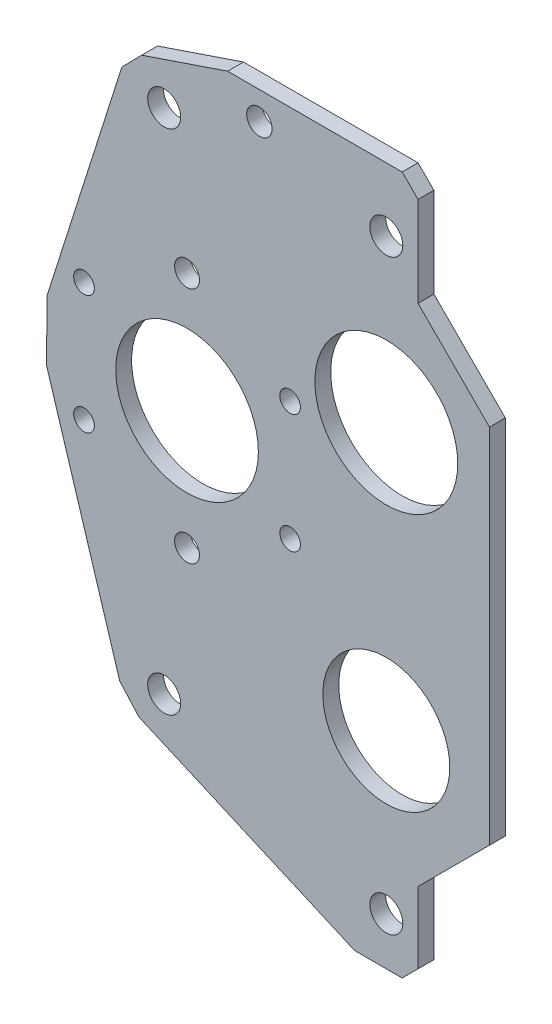
ISO-10303-21;
HEADER;
FILE_DESCRIPTION(('STEP AP214'),'2;1');
FILE_NAME('part.step','',(''),(''),'','','');
FILE_SCHEMA(('AUTOMOTIVE_DESIGN { 1 0 10303 214 1 1 1 1 }'));
ENDSEC;
DATA;
#1=APPLICATION_CONTEXT('core data for automotive mechanical design processes');
#2=APPLICATION_PROTOCOL_DEFINITION('international standard','automotive_design',2000,#1);
#3=PRODUCT_CONTEXT('',#1,'mechanical');
#4=PRODUCT('Part','Part','',(#3));
#5=PRODUCT_RELATED_PRODUCT_CATEGORY('part','',(#4));
#6=PRODUCT_DEFINITION_FORMATION('','',#4);
#7=PRODUCT_DEFINITION_CONTEXT('part definition',#1,'design');
#8=PRODUCT_DEFINITION('design','',#6,#7);
#9=PRODUCT_DEFINITION_SHAPE('','',#8);
#10=(LENGTH_UNIT() NAMED_UNIT(*) SI_UNIT(.MILLI.,.METRE.));
#11=(NAMED_UNIT(*) PLANE_ANGLE_UNIT() SI_UNIT($,.RADIAN.));
#12=(NAMED_UNIT(*) SI_UNIT($,.STERADIAN.) SOLID_ANGLE_UNIT());
#13=UNCERTAINTY_MEASURE_WITH_UNIT(LENGTH_MEASURE(1.E-05),#10,'distance_accuracy_value','');
#14=(GEOMETRIC_REPRESENTATION_CONTEXT(3) GLOBAL_UNCERTAINTY_ASSIGNED_CONTEXT((#13)) GLOBAL_UNIT_ASSIGNED_CONTEXT((#10,
#11,#12)) REPRESENTATION_CONTEXT('',''));
#15=CARTESIAN_POINT('',(0.,0.,0.));
#16=DIRECTION('',(0.,0.,1.));
#17=DIRECTION('',(1.,0.,0.));
#18=AXIS2_PLACEMENT_3D('',#15,#16,#17);
#19=CARTESIAN_POINT('',(0.,0.,0.));
#20=DIRECTION('',(0.,0.,1.));
#21=DIRECTION('',(1.,0.,0.));
#22=AXIS2_PLACEMENT_3D('',#19,#20,#21);
#23=PLANE('',#22);
#24=DIRECTION('',(-0.947188076798087,-0.32067857298476,0.));
#25=VECTOR('',#24,1.);
#26=CARTESIAN_POINT('',(-33.1609002039906,97.9473277455423,0.));
#27=LINE('',#26,#25);
#28=CARTESIAN_POINT('',(-48.9538078594664,92.6005046443076,0.));
#29=VERTEX_POINT('',#28);
#30=CARTESIAN_POINT('',(-31.75,98.425,0.));
#31=VERTEX_POINT('',#30);
#32=EDGE_CURVE('E666',#29,#31,#27,.F.);
#33=ORIENTED_EDGE('',*,*,#32,.F.);
#34=DIRECTION('',(0.7004757379388,0.713676215492077,0.));
#35=VECTOR('',#34,1.);
#36=CARTESIAN_POINT('',(-48.9538078594664,92.6005046443076,0.));
#37=LINE('',#36,#35);
#38=CARTESIAN_POINT('',(-52.9229679271194,88.5565456856429,0.));
#39=VERTEX_POINT('',#38);
#40=EDGE_CURVE('E658',#29,#39,#37,.F.);
#41=ORIENTED_EDGE('',*,*,#40,.T.);
#42=DIRECTION('',(-0.302941078368201,-0.953009288011985,0.));
#43=VECTOR('',#42,1.);
#44=CARTESIAN_POINT('',(-73.6328287693253,23.4062866241446,0.));
#45=LINE('',#44,#43);
#46=CARTESIAN_POINT('',(-67.9263241523619,41.3581336676134,0.));
#47=VERTEX_POINT('',#46);
#48=EDGE_CURVE('E656',#47,#39,#45,.F.);
#49=ORIENTED_EDGE('',*,*,#48,.F.);
#50=DIRECTION('',(0.00396394921512312,0.999992143522448,0.));
#51=VECTOR('',#50,1.);
#52=CARTESIAN_POINT('',(-67.9263241523619,41.3581336676133,0.));
#53=LINE('',#52,#51);
#54=CARTESIAN_POINT('',(-67.9743607697863,29.2398552995184,0.));
#55=VERTEX_POINT('',#54);
#56=EDGE_CURVE('E649',#47,#55,#53,.F.);
#57=ORIENTED_EDGE('',*,*,#56,.T.);
#58=DIRECTION('',(0.295376256726555,-0.955381006176179,0.));
#59=VECTOR('',#58,1.);
#60=CARTESIAN_POINT('',(-53.7923971636767,-16.6310579882147,0.));
#61=LINE('',#60,#59);
#62=CARTESIAN_POINT('',(-53.3456573135953,-18.0760176210564,0.));
#63=VERTEX_POINT('',#62);
#64=EDGE_CURVE('E145',#63,#55,#61,.F.);
#65=ORIENTED_EDGE('',*,*,#64,.F.);
#66=DIRECTION('',(-0.666107578502949,0.745855678976126,0.));
#67=VECTOR('',#66,1.);
#68=CARTESIAN_POINT('',(-53.3456573135953,-18.0760176210564,0.));
#69=LINE('',#68,#67);
#70=CARTESIAN_POINT('',(-49.4993940732019,-22.3827653195768,0.));
#71=VERTEX_POINT('',#70);
#72=EDGE_CURVE('E140',#63,#71,#69,.F.);
#73=ORIENTED_EDGE('',*,*,#72,.T.);
#74=DIRECTION('',(0.916045236310745,-0.401074961861734,0.));
#75=VECTOR('',#74,1.);
#76=CARTESIAN_POINT('',(-16.1860190531105,-36.9684648964657,0.));
#77=LINE('',#76,#75);
#78=CARTESIAN_POINT('',(-6.34999999999987,-41.275,0.));
#79=VERTEX_POINT('',#78);
#80=EDGE_CURVE('E131',#79,#71,#77,.F.);
#81=ORIENTED_EDGE('',*,*,#80,.F.);
#82=DIRECTION('',(1.,0.,0.));
#83=VECTOR('',#82,1.);
#84=CARTESIAN_POINT('',(-76.2,-41.275,0.));
#85=LINE('',#84,#83);
#86=CARTESIAN_POINT('',(3.17499999999999,-41.275,0.));
#87=VERTEX_POINT('',#86);
#88=EDGE_CURVE('E126',#87,#79,#85,.F.);
#89=ORIENTED_EDGE('',*,*,#88,.F.);
#90=DIRECTION('',(0.707106781186547,0.707106781186548,0.));
#91=VECTOR('',#90,1.);
#92=CARTESIAN_POINT('',(6.35,-38.1,0.));
#93=LINE('',#92,#91);
#94=CARTESIAN_POINT('',(6.35,-38.1,0.));
#95=VERTEX_POINT('',#94);
#96=EDGE_CURVE('E703',#95,#87,#93,.F.);
#97=ORIENTED_EDGE('',*,*,#96,.F.);
#98=DIRECTION('',(0.,-1.,0.));
#99=VECTOR('',#98,1.);
#100=CARTESIAN_POINT('',(6.35000000000001,-23.8252,0.));
#101=LINE('',#100,#99);
#102=CARTESIAN_POINT('',(6.35,-23.8252,0.));
#103=VERTEX_POINT('',#102);
#104=EDGE_CURVE('E697',#95,#103,#101,.F.);
#105=ORIENTED_EDGE('',*,*,#104,.T.);
#106=DIRECTION('',(-0.707106781186549,-0.707106781186546,0.));
#107=VECTOR('',#106,1.);
#108=CARTESIAN_POINT('',(20.6502,-9.525,0.));
#109=LINE('',#108,#107);
#110=CARTESIAN_POINT('',(20.6502,-9.52500000000001,0.));
#111=VERTEX_POINT('',#110);
#112=EDGE_CURVE('E692',#103,#111,#109,.F.);
#113=ORIENTED_EDGE('',*,*,#112,.T.);
#114=DIRECTION('',(0.,-1.,0.));
#115=VECTOR('',#114,1.);
#116=CARTESIAN_POINT('',(20.6502,62.9412,0.));
#117=LINE('',#116,#115);
#118=CARTESIAN_POINT('',(20.6502,62.9412,0.));
#119=VERTEX_POINT('',#118);
#120=EDGE_CURVE('E687',#111,#119,#117,.F.);
#121=ORIENTED_EDGE('',*,*,#120,.T.);
#122=DIRECTION('',(0.707106781186549,-0.707106781186546,0.));
#123=VECTOR('',#122,1.);
#124=CARTESIAN_POINT('',(6.35000000000002,77.2414,0.));
#125=LINE('',#124,#123);
#126=CARTESIAN_POINT('',(6.35000000000002,77.2414,0.));
#127=VERTEX_POINT('',#126);
#128=EDGE_CURVE('E682',#119,#127,#125,.F.);
#129=ORIENTED_EDGE('',*,*,#128,.T.);
#130=DIRECTION('',(0.,-1.,0.));
#131=VECTOR('',#130,1.);
#132=CARTESIAN_POINT('',(6.35000000000002,98.425,0.));
#133=LINE('',#132,#131);
#134=CARTESIAN_POINT('',(6.35000000000002,95.25,0.));
#135=VERTEX_POINT('',#134);
#136=EDGE_CURVE('E676',#127,#135,#133,.F.);
#137=ORIENTED_EDGE('',*,*,#136,.T.);
#138=DIRECTION('',(-0.707106781186547,0.707106781186548,0.));
#139=VECTOR('',#138,1.);
#140=CARTESIAN_POINT('',(3.17500000000003,98.425,0.));
#141=LINE('',#140,#139);
#142=CARTESIAN_POINT('',(3.17500000000003,98.425,0.));
#143=VERTEX_POINT('',#142);
#144=EDGE_CURVE('E674',#143,#135,#141,.F.);
#145=ORIENTED_EDGE('',*,*,#144,.F.);
#146=DIRECTION('',(1.,0.,0.));
#147=VECTOR('',#146,1.);
#148=CARTESIAN_POINT('',(-76.2,98.425,0.));
#149=LINE('',#148,#147);
#150=EDGE_CURVE('E670',#31,#143,#149,.T.);
#151=ORIENTED_EDGE('',*,*,#150,.F.);
#152=EDGE_LOOP('',(#33,#41,#49,#57,#65,#73,#81,#89,#97,#105,#113,#121,#129,#137,#145,#151));
#153=FACE_BOUND('',#152,.T.);
#154=CARTESIAN_POINT('',(0.,-31.75,0.));
#155=DIRECTION('',(0.,0.,1.));
#156=DIRECTION('',(1.,0.,0.));
#157=AXIS2_PLACEMENT_3D('',#154,#155,#156);
#158=CIRCLE('',#157,3.302);
#159=CARTESIAN_POINT('',(3.30199999999998,-31.75,0.));
#160=VERTEX_POINT('',#159);
#161=EDGE_CURVE('E149',#160,#160,#158,.F.);
#162=ORIENTED_EDGE('',*,*,#161,.T.);
#163=EDGE_LOOP('',(#162));
#164=FACE_BOUND('',#163,.T.);
#165=CARTESIAN_POINT('',(0.,85.725,0.));
#166=DIRECTION('',(0.,0.,1.));
#167=DIRECTION('',(1.,0.,0.));
#168=AXIS2_PLACEMENT_3D('',#165,#166,#167);
#169=CIRCLE('',#168,3.30199999999999);
#170=CARTESIAN_POINT('',(3.30199999999996,85.725,0.));
#171=VERTEX_POINT('',#170);
#172=EDGE_CURVE('E203',#171,#171,#169,.F.);
#173=ORIENTED_EDGE('',*,*,#172,.T.);
#174=EDGE_LOOP('',(#173));
#175=FACE_BOUND('',#174,.T.);
#176=CARTESIAN_POINT('',(-25.4,92.8624,0.));
#177=DIRECTION('',(0.,0.,1.));
#178=DIRECTION('',(1.,0.,0.));
#179=AXIS2_PLACEMENT_3D('',#176,#177,#178);
#180=CIRCLE('',#179,2.54);
#181=CARTESIAN_POINT('',(-22.86,92.8624,0.));
#182=VERTEX_POINT('',#181);
#183=EDGE_CURVE('E206',#182,#182,#180,.F.);
#184=ORIENTED_EDGE('',*,*,#183,.T.);
#185=EDGE_LOOP('',(#184));
#186=FACE_BOUND('',#185,.T.);
#187=CARTESIAN_POINT('',(0.,53.4162,0.));
#188=DIRECTION('',(0.,0.,1.));
#189=DIRECTION('',(1.,0.,0.));
#190=AXIS2_PLACEMENT_3D('',#187,#188,#189);
#191=CIRCLE('',#190,14.3002);
#192=CARTESIAN_POINT('',(14.3002,53.4162,0.));
#193=VERTEX_POINT('',#192);
#194=EDGE_CURVE('E209',#193,#193,#191,.F.);
#195=ORIENTED_EDGE('',*,*,#194,.T.);
#196=EDGE_LOOP('',(#195));
#197=FACE_BOUND('',#196,.T.);
#198=CARTESIAN_POINT('',(-39.878,35.5392112804997,0.));
#199=DIRECTION('',(0.,0.,1.));
#200=DIRECTION('',(1.,0.,0.));
#201=AXIS2_PLACEMENT_3D('',#198,#199,#200);
#202=CIRCLE('',#201,14.2748);
#203=CARTESIAN_POINT('',(-25.6032,35.5392112804997,0.));
#204=VERTEX_POINT('',#203);
#205=EDGE_CURVE('E212',#204,#204,#202,.F.);
#206=ORIENTED_EDGE('',*,*,#205,.T.);
#207=EDGE_LOOP('',(#206));
#208=FACE_BOUND('',#207,.T.);
#209=CARTESIAN_POINT('',(0.,0.,0.));
#210=DIRECTION('',(0.,0.,1.));
#211=DIRECTION('',(1.,0.,0.));
#212=AXIS2_PLACEMENT_3D('',#209,#210,#211);
#213=CIRCLE('',#212,12.7);
#214=CARTESIAN_POINT('',(12.7,0.,0.));
#215=VERTEX_POINT('',#214);
#216=EDGE_CURVE('E215',#215,#215,#213,.F.);
#217=ORIENTED_EDGE('',*,*,#216,.T.);
#218=EDGE_LOOP('',(#217));
#219=FACE_BOUND('',#218,.T.);
#220=CARTESIAN_POINT('',(-44.45,-15.875,0.));
#221=DIRECTION('',(0.,0.,1.));
#222=DIRECTION('',(1.,0.,0.));
#223=AXIS2_PLACEMENT_3D('',#220,#221,#222);
#224=CIRCLE('',#223,3.302);
#225=CARTESIAN_POINT('',(-41.148,-15.875,0.));
#226=VERTEX_POINT('',#225);
#227=EDGE_CURVE('E218',#226,#226,#224,.F.);
#228=ORIENTED_EDGE('',*,*,#227,.T.);
#229=EDGE_LOOP('',(#228));
#230=FACE_BOUND('',#229,.T.);
#231=CARTESIAN_POINT('',(-44.45,85.725,0.));
#232=DIRECTION('',(0.,0.,1.));
#233=DIRECTION('',(1.,0.,0.));
#234=AXIS2_PLACEMENT_3D('',#231,#232,#233);
#235=CIRCLE('',#234,3.302);
#236=CARTESIAN_POINT('',(-41.148,85.725,0.));
#237=VERTEX_POINT('',#236);
#238=EDGE_CURVE('E221',#237,#237,#235,.F.);
#239=ORIENTED_EDGE('',*,*,#238,.T.);
#240=EDGE_LOOP('',(#239));
#241=FACE_BOUND('',#240,.T.);
#242=CARTESIAN_POINT('',(-39.878,11.7267112804997,0.));
#243=DIRECTION('',(0.,0.,-1.));
#244=DIRECTION('',(-1.,0.,0.));
#245=AXIS2_PLACEMENT_3D('',#242,#243,#244);
#246=CIRCLE('',#245,2.4892);
#247=CARTESIAN_POINT('',(-42.3672,11.7267112804997,0.));
#248=VERTEX_POINT('',#247);
#249=EDGE_CURVE('E224',#248,#248,#246,.T.);
#250=ORIENTED_EDGE('',*,*,#249,.T.);
#251=EDGE_LOOP('',(#250));
#252=FACE_BOUND('',#251,.T.);
#253=CARTESIAN_POINT('',(-19.255770072383,23.6329612804998,0.));
#254=DIRECTION('',(0.,0.,-1.));
#255=DIRECTION('',(-1.,0.,0.));
#256=AXIS2_PLACEMENT_3D('',#253,#254,#255);
#257=CIRCLE('',#256,2.0701);
#258=CARTESIAN_POINT('',(-21.325870072383,23.6329612804998,0.));
#259=VERTEX_POINT('',#258);
#260=EDGE_CURVE('E227',#259,#259,#257,.T.);
#261=ORIENTED_EDGE('',*,*,#260,.T.);
#262=EDGE_LOOP('',(#261));
#263=FACE_BOUND('',#262,.T.);
#264=CARTESIAN_POINT('',(-19.2557700723831,47.4454612804998,0.));
#265=DIRECTION('',(0.,0.,-1.));
#266=DIRECTION('',(-1.,0.,0.));
#267=AXIS2_PLACEMENT_3D('',#264,#265,#266);
#268=CIRCLE('',#267,2.07010000000001);
#269=CARTESIAN_POINT('',(-21.3258700723831,47.4454612804998,0.));
#270=VERTEX_POINT('',#269);
#271=EDGE_CURVE('E230',#270,#270,#268,.T.);
#272=ORIENTED_EDGE('',*,*,#271,.T.);
#273=EDGE_LOOP('',(#272));
#274=FACE_BOUND('',#273,.T.);
#275=CARTESIAN_POINT('',(-39.878,59.3517112804997,0.));
#276=DIRECTION('',(0.,0.,-1.));
#277=DIRECTION('',(-1.,0.,0.));
#278=AXIS2_PLACEMENT_3D('',#275,#276,#277);
#279=CIRCLE('',#278,2.4892);
#280=CARTESIAN_POINT('',(-42.3672,59.3517112804997,0.));
#281=VERTEX_POINT('',#280);
#282=EDGE_CURVE('E233',#281,#281,#279,.T.);
#283=ORIENTED_EDGE('',*,*,#282,.T.);
#284=EDGE_LOOP('',(#283));
#285=FACE_BOUND('',#284,.T.);
#286=CARTESIAN_POINT('',(-60.5002299276169,23.6329612804996,0.));
#287=DIRECTION('',(0.,0.,-1.));
#288=DIRECTION('',(-1.,0.,0.));
#289=AXIS2_PLACEMENT_3D('',#286,#287,#288);
#290=CIRCLE('',#289,2.0701);
#291=CARTESIAN_POINT('',(-62.5703299276169,23.6329612804996,0.));
#292=VERTEX_POINT('',#291);
#293=EDGE_CURVE('E235',#292,#292,#290,.T.);
#294=ORIENTED_EDGE('',*,*,#293,.T.);
#295=EDGE_LOOP('',(#294));
#296=FACE_BOUND('',#295,.T.);
#297=CARTESIAN_POINT('',(-60.500229927617,47.4454612804997,0.));
#298=DIRECTION('',(0.,0.,-1.));
#299=DIRECTION('',(-1.,0.,0.));
#300=AXIS2_PLACEMENT_3D('',#297,#298,#299);
#301=CIRCLE('',#300,2.07009999999999);
#302=CARTESIAN_POINT('',(-62.570329927617,47.4454612804997,0.));
#303=VERTEX_POINT('',#302);
#304=EDGE_CURVE('E20',#303,#303,#301,.T.);
#305=ORIENTED_EDGE('',*,*,#304,.T.);
#306=EDGE_LOOP('',(#305));
#307=FACE_BOUND('',#306,.T.);
#308=ADVANCED_FACE('F17',(#153,#164,#175,#186,#197,#208,#219,#230,#241,#252,#263,#274,#285,#296,
#307),#23,.T.);
#309=CARTESIAN_POINT('',(-60.500229927617,47.4454612804997,0.));
#310=DIRECTION('',(0.,0.,-1.));
#311=DIRECTION('',(-1.,0.,0.));
#312=AXIS2_PLACEMENT_3D('',#309,#310,#311);
#313=CYLINDRICAL_SURFACE('',#312,2.07009999999999);
#314=ORIENTED_EDGE('',*,*,#304,.F.);
#315=EDGE_LOOP('',(#314));
#316=FACE_BOUND('',#315,.T.);
#317=CARTESIAN_POINT('',(-60.500229927617,47.4454612804997,-3.175));
#318=DIRECTION('',(0.,0.,-1.));
#319=DIRECTION('',(-1.,0.,0.));
#320=AXIS2_PLACEMENT_3D('',#317,#318,#319);
#321=CIRCLE('',#320,2.07009999999999);
#322=CARTESIAN_POINT('',(-62.570329927617,47.4454612804997,-3.175));
#323=VERTEX_POINT('',#322);
#324=EDGE_CURVE('E197',#323,#323,#321,.T.);
#325=ORIENTED_EDGE('',*,*,#324,.T.);
#326=EDGE_LOOP('',(#325));
#327=FACE_BOUND('',#326,.T.);
#328=ADVANCED_FACE('F243',(#316,#327),#313,.F.);
#329=CARTESIAN_POINT('',(-60.5002299276169,23.6329612804996,0.));
#330=DIRECTION('',(0.,0.,-1.));
#331=DIRECTION('',(-1.,0.,0.));
#332=AXIS2_PLACEMENT_3D('',#329,#330,#331);
#333=CYLINDRICAL_SURFACE('',#332,2.0701);
#334=ORIENTED_EDGE('',*,*,#293,.F.);
#335=EDGE_LOOP('',(#334));
#336=FACE_BOUND('',#335,.T.);
#337=CARTESIAN_POINT('',(-60.5002299276169,23.6329612804996,-3.175));
#338=DIRECTION('',(0.,0.,-1.));
#339=DIRECTION('',(-1.,0.,0.));
#340=AXIS2_PLACEMENT_3D('',#337,#338,#339);
#341=CIRCLE('',#340,2.0701);
#342=CARTESIAN_POINT('',(-62.5703299276169,23.6329612804996,-3.175));
#343=VERTEX_POINT('',#342);
#344=EDGE_CURVE('E194',#343,#343,#341,.T.);
#345=ORIENTED_EDGE('',*,*,#344,.T.);
#346=EDGE_LOOP('',(#345));
#347=FACE_BOUND('',#346,.T.);
#348=ADVANCED_FACE('F246',(#336,#347),#333,.F.);
#349=CARTESIAN_POINT('',(-39.878,59.3517112804997,0.));
#350=DIRECTION('',(0.,0.,-1.));
#351=DIRECTION('',(-1.,0.,0.));
#352=AXIS2_PLACEMENT_3D('',#349,#350,#351);
#353=CYLINDRICAL_SURFACE('',#352,2.4892);
#354=ORIENTED_EDGE('',*,*,#282,.F.);
#355=EDGE_LOOP('',(#354));
#356=FACE_BOUND('',#355,.T.);
#357=CARTESIAN_POINT('',(-39.878,59.3517112804997,-3.175));
#358=DIRECTION('',(0.,0.,-1.));
#359=DIRECTION('',(-1.,0.,0.));
#360=AXIS2_PLACEMENT_3D('',#357,#358,#359);
#361=CIRCLE('',#360,2.4892);
#362=CARTESIAN_POINT('',(-42.3672,59.3517112804997,-3.175));
#363=VERTEX_POINT('',#362);
#364=EDGE_CURVE('E191',#363,#363,#361,.T.);
#365=ORIENTED_EDGE('',*,*,#364,.T.);
#366=EDGE_LOOP('',(#365));
#367=FACE_BOUND('',#366,.T.);
#368=ADVANCED_FACE('F360',(#356,#367),#353,.F.);
#369=CARTESIAN_POINT('',(-19.2557700723831,47.4454612804998,0.));
#370=DIRECTION('',(0.,0.,-1.));
#371=DIRECTION('',(-1.,0.,0.));
#372=AXIS2_PLACEMENT_3D('',#369,#370,#371);
#373=CYLINDRICAL_SURFACE('',#372,2.07010000000001);
#374=ORIENTED_EDGE('',*,*,#271,.F.);
#375=EDGE_LOOP('',(#374));
#376=FACE_BOUND('',#375,.T.);
#377=CARTESIAN_POINT('',(-19.2557700723831,47.4454612804998,-3.175));
#378=DIRECTION('',(0.,0.,-1.));
#379=DIRECTION('',(-1.,0.,0.));
#380=AXIS2_PLACEMENT_3D('',#377,#378,#379);
#381=CIRCLE('',#380,2.07010000000001);
#382=CARTESIAN_POINT('',(-21.3258700723831,47.4454612804998,-3.175));
#383=VERTEX_POINT('',#382);
#384=EDGE_CURVE('E188',#383,#383,#381,.T.);
#385=ORIENTED_EDGE('',*,*,#384,.T.);
#386=EDGE_LOOP('',(#385));
#387=FACE_BOUND('',#386,.T.);
#388=ADVANCED_FACE('F356',(#376,#387),#373,.F.);
#389=CARTESIAN_POINT('',(-19.255770072383,23.6329612804998,0.));
#390=DIRECTION('',(0.,0.,-1.));
#391=DIRECTION('',(-1.,0.,0.));
#392=AXIS2_PLACEMENT_3D('',#389,#390,#391);
#393=CYLINDRICAL_SURFACE('',#392,2.0701);
#394=ORIENTED_EDGE('',*,*,#260,.F.);
#395=EDGE_LOOP('',(#394));
#396=FACE_BOUND('',#395,.T.);
#397=CARTESIAN_POINT('',(-19.255770072383,23.6329612804998,-3.175));
#398=DIRECTION('',(0.,0.,-1.));
#399=DIRECTION('',(-1.,0.,0.));
#400=AXIS2_PLACEMENT_3D('',#397,#398,#399);
#401=CIRCLE('',#400,2.0701);
#402=CARTESIAN_POINT('',(-21.325870072383,23.6329612804998,-3.175));
#403=VERTEX_POINT('',#402);
#404=EDGE_CURVE('E185',#403,#403,#401,.T.);
#405=ORIENTED_EDGE('',*,*,#404,.T.);
#406=EDGE_LOOP('',(#405));
#407=FACE_BOUND('',#406,.T.);
#408=ADVANCED_FACE('F352',(#396,#407),#393,.F.);
#409=CARTESIAN_POINT('',(-39.878,11.7267112804997,0.));
#410=DIRECTION('',(0.,0.,-1.));
#411=DIRECTION('',(-1.,0.,0.));
#412=AXIS2_PLACEMENT_3D('',#409,#410,#411);
#413=CYLINDRICAL_SURFACE('',#412,2.4892);
#414=ORIENTED_EDGE('',*,*,#249,.F.);
#415=EDGE_LOOP('',(#414));
#416=FACE_BOUND('',#415,.T.);
#417=CARTESIAN_POINT('',(-39.878,11.7267112804997,-3.175));
#418=DIRECTION('',(0.,0.,-1.));
#419=DIRECTION('',(-1.,0.,0.));
#420=AXIS2_PLACEMENT_3D('',#417,#418,#419);
#421=CIRCLE('',#420,2.4892);
#422=CARTESIAN_POINT('',(-42.3672,11.7267112804997,-3.175));
#423=VERTEX_POINT('',#422);
#424=EDGE_CURVE('E182',#423,#423,#421,.T.);
#425=ORIENTED_EDGE('',*,*,#424,.T.);
#426=EDGE_LOOP('',(#425));
#427=FACE_BOUND('',#426,.T.);
#428=ADVANCED_FACE('F348',(#416,#427),#413,.F.);
#429=CARTESIAN_POINT('',(-44.45,85.725,-3.175));
#430=DIRECTION('',(0.,0.,1.));
#431=DIRECTION('',(1.,0.,0.));
#432=AXIS2_PLACEMENT_3D('',#429,#430,#431);
#433=CYLINDRICAL_SURFACE('',#432,3.302);
#434=CARTESIAN_POINT('',(-44.45,85.725,-3.175));
#435=DIRECTION('',(0.,0.,1.));
#436=DIRECTION('',(1.,0.,0.));
#437=AXIS2_PLACEMENT_3D('',#434,#435,#436);
#438=CIRCLE('',#437,3.302);
#439=CARTESIAN_POINT('',(-41.148,85.725,-3.175));
#440=VERTEX_POINT('',#439);
#441=EDGE_CURVE('E179',#440,#440,#438,.F.);
#442=ORIENTED_EDGE('',*,*,#441,.T.);
#443=EDGE_LOOP('',(#442));
#444=FACE_BOUND('',#443,.T.);
#445=ORIENTED_EDGE('',*,*,#238,.F.);
#446=EDGE_LOOP('',(#445));
#447=FACE_BOUND('',#446,.T.);
#448=ADVANCED_FACE('F344',(#444,#447),#433,.F.);
#449=CARTESIAN_POINT('',(-44.45,-15.875,-3.175));
#450=DIRECTION('',(0.,0.,1.));
#451=DIRECTION('',(1.,0.,0.));
#452=AXIS2_PLACEMENT_3D('',#449,#450,#451);
#453=CYLINDRICAL_SURFACE('',#452,3.302);
#454=CARTESIAN_POINT('',(-44.45,-15.875,-3.175));
#455=DIRECTION('',(0.,0.,1.));
#456=DIRECTION('',(1.,0.,0.));
#457=AXIS2_PLACEMENT_3D('',#454,#455,#456);
#458=CIRCLE('',#457,3.302);
#459=CARTESIAN_POINT('',(-41.148,-15.875,-3.175));
#460=VERTEX_POINT('',#459);
#461=EDGE_CURVE('E176',#460,#460,#458,.F.);
#462=ORIENTED_EDGE('',*,*,#461,.T.);
#463=EDGE_LOOP('',(#462));
#464=FACE_BOUND('',#463,.T.);
#465=ORIENTED_EDGE('',*,*,#227,.F.);
#466=EDGE_LOOP('',(#465));
#467=FACE_BOUND('',#466,.T.);
#468=ADVANCED_FACE('F340',(#464,#467),#453,.F.);
#469=CARTESIAN_POINT('',(0.,0.,-3.175));
#470=DIRECTION('',(0.,0.,1.));
#471=DIRECTION('',(1.,0.,0.));
#472=AXIS2_PLACEMENT_3D('',#469,#470,#471);
#473=CYLINDRICAL_SURFACE('',#472,12.7);
#474=CARTESIAN_POINT('',(0.,0.,-3.175));
#475=DIRECTION('',(0.,0.,1.));
#476=DIRECTION('',(1.,0.,0.));
#477=AXIS2_PLACEMENT_3D('',#474,#475,#476);
#478=CIRCLE('',#477,12.7);
#479=CARTESIAN_POINT('',(12.7,0.,-3.175));
#480=VERTEX_POINT('',#479);
#481=EDGE_CURVE('E173',#480,#480,#478,.F.);
#482=ORIENTED_EDGE('',*,*,#481,.T.);
#483=EDGE_LOOP('',(#482));
#484=FACE_BOUND('',#483,.T.);
#485=ORIENTED_EDGE('',*,*,#216,.F.);
#486=EDGE_LOOP('',(#485));
#487=FACE_BOUND('',#486,.T.);
#488=ADVANCED_FACE('F336',(#484,#487),#473,.F.);
#489=CARTESIAN_POINT('',(-39.878,35.5392112804997,-3.175));
#490=DIRECTION('',(0.,0.,1.));
#491=DIRECTION('',(1.,0.,0.));
#492=AXIS2_PLACEMENT_3D('',#489,#490,#491);
#493=CYLINDRICAL_SURFACE('',#492,14.2748);
#494=CARTESIAN_POINT('',(-39.878,35.5392112804997,-3.175));
#495=DIRECTION('',(0.,0.,1.));
#496=DIRECTION('',(1.,0.,0.));
#497=AXIS2_PLACEMENT_3D('',#494,#495,#496);
#498=CIRCLE('',#497,14.2748);
#499=CARTESIAN_POINT('',(-25.6032,35.5392112804997,-3.175));
#500=VERTEX_POINT('',#499);
#501=EDGE_CURVE('E170',#500,#500,#498,.F.);
#502=ORIENTED_EDGE('',*,*,#501,.T.);
#503=EDGE_LOOP('',(#502));
#504=FACE_BOUND('',#503,.T.);
#505=ORIENTED_EDGE('',*,*,#205,.F.);
#506=EDGE_LOOP('',(#505));
#507=FACE_BOUND('',#506,.T.);
#508=ADVANCED_FACE('F332',(#504,#507),#493,.F.);
#509=CARTESIAN_POINT('',(0.,53.4162,-3.175));
#510=DIRECTION('',(0.,0.,1.));
#511=DIRECTION('',(1.,0.,0.));
#512=AXIS2_PLACEMENT_3D('',#509,#510,#511);
#513=CYLINDRICAL_SURFACE('',#512,14.3002);
#514=CARTESIAN_POINT('',(0.,53.4162,-3.175));
#515=DIRECTION('',(0.,0.,1.));
#516=DIRECTION('',(1.,0.,0.));
#517=AXIS2_PLACEMENT_3D('',#514,#515,#516);
#518=CIRCLE('',#517,14.3002);
#519=CARTESIAN_POINT('',(14.3002,53.4162,-3.175));
#520=VERTEX_POINT('',#519);
#521=EDGE_CURVE('E167',#520,#520,#518,.F.);
#522=ORIENTED_EDGE('',*,*,#521,.T.);
#523=EDGE_LOOP('',(#522));
#524=FACE_BOUND('',#523,.T.);
#525=ORIENTED_EDGE('',*,*,#194,.F.);
#526=EDGE_LOOP('',(#525));
#527=FACE_BOUND('',#526,.T.);
#528=ADVANCED_FACE('F328',(#524,#527),#513,.F.);
#529=CARTESIAN_POINT('',(-25.4,92.8624,-3.175));
#530=DIRECTION('',(0.,0.,1.));
#531=DIRECTION('',(1.,0.,0.));
#532=AXIS2_PLACEMENT_3D('',#529,#530,#531);
#533=CYLINDRICAL_SURFACE('',#532,2.54);
#534=CARTESIAN_POINT('',(-25.4,92.8624,-3.175));
#535=DIRECTION('',(0.,0.,1.));
#536=DIRECTION('',(1.,0.,0.));
#537=AXIS2_PLACEMENT_3D('',#534,#535,#536);
#538=CIRCLE('',#537,2.54);
#539=CARTESIAN_POINT('',(-22.86,92.8624,-3.175));
#540=VERTEX_POINT('',#539);
#541=EDGE_CURVE('E164',#540,#540,#538,.F.);
#542=ORIENTED_EDGE('',*,*,#541,.T.);
#543=EDGE_LOOP('',(#542));
#544=FACE_BOUND('',#543,.T.);
#545=ORIENTED_EDGE('',*,*,#183,.F.);
#546=EDGE_LOOP('',(#545));
#547=FACE_BOUND('',#546,.T.);
#548=ADVANCED_FACE('F324',(#544,#547),#533,.F.);
#549=CARTESIAN_POINT('',(0.,85.725,-3.175));
#550=DIRECTION('',(0.,0.,1.));
#551=DIRECTION('',(1.,0.,0.));
#552=AXIS2_PLACEMENT_3D('',#549,#550,#551);
#553=CYLINDRICAL_SURFACE('',#552,3.30199999999999);
#554=CARTESIAN_POINT('',(0.,85.725,-3.175));
#555=DIRECTION('',(0.,0.,1.));
#556=DIRECTION('',(1.,0.,0.));
#557=AXIS2_PLACEMENT_3D('',#554,#555,#556);
#558=CIRCLE('',#557,3.30199999999999);
#559=CARTESIAN_POINT('',(3.30199999999996,85.725,-3.175));
#560=VERTEX_POINT('',#559);
#561=EDGE_CURVE('E161',#560,#560,#558,.F.);
#562=ORIENTED_EDGE('',*,*,#561,.T.);
#563=EDGE_LOOP('',(#562));
#564=FACE_BOUND('',#563,.T.);
#565=ORIENTED_EDGE('',*,*,#172,.F.);
#566=EDGE_LOOP('',(#565));
#567=FACE_BOUND('',#566,.T.);
#568=ADVANCED_FACE('F320',(#564,#567),#553,.F.);
#569=CARTESIAN_POINT('',(0.,-31.75,-3.175));
#570=DIRECTION('',(0.,0.,1.));
#571=DIRECTION('',(1.,0.,0.));
#572=AXIS2_PLACEMENT_3D('',#569,#570,#571);
#573=CYLINDRICAL_SURFACE('',#572,3.302);
#574=CARTESIAN_POINT('',(0.,-31.75,-3.175));
#575=DIRECTION('',(0.,0.,1.));
#576=DIRECTION('',(1.,0.,0.));
#577=AXIS2_PLACEMENT_3D('',#574,#575,#576);
#578=CIRCLE('',#577,3.302);
#579=CARTESIAN_POINT('',(3.30199999999998,-31.75,-3.175));
#580=VERTEX_POINT('',#579);
#581=EDGE_CURVE('E158',#580,#580,#578,.F.);
#582=ORIENTED_EDGE('',*,*,#581,.T.);
#583=EDGE_LOOP('',(#582));
#584=FACE_BOUND('',#583,.T.);
#585=ORIENTED_EDGE('',*,*,#161,.F.);
#586=EDGE_LOOP('',(#585));
#587=FACE_BOUND('',#586,.T.);
#588=ADVANCED_FACE('F317',(#584,#587),#573,.F.);
#589=CARTESIAN_POINT('',(-53.3456573135953,-18.0760176210564,-3.175));
#590=DIRECTION('',(0.745855678976126,0.666107578502949,0.));
#591=DIRECTION('',(-0.666107578502949,0.745855678976126,0.));
#592=AXIS2_PLACEMENT_3D('',#589,#590,#591);
#593=PLANE('',#592);
#594=DIRECTION('',(0.,0.,1.));
#595=VECTOR('',#594,1.);
#596=CARTESIAN_POINT('',(-49.4993940732019,-22.3827653195767,-3.175));
#597=LINE('',#596,#595);
#598=CARTESIAN_POINT('',(-49.4993940732019,-22.3827653195768,-3.175));
#599=VERTEX_POINT('',#598);
#600=EDGE_CURVE('E136',#71,#599,#597,.F.);
#601=ORIENTED_EDGE('',*,*,#600,.F.);
#602=ORIENTED_EDGE('',*,*,#72,.F.);
#603=DIRECTION('',(0.,0.,1.));
#604=VECTOR('',#603,1.);
#605=CARTESIAN_POINT('',(-53.3456573135953,-18.0760176210564,-3.175));
#606=LINE('',#605,#604);
#607=CARTESIAN_POINT('',(-53.3456573135953,-18.0760176210564,-3.175));
#608=VERTEX_POINT('',#607);
#609=EDGE_CURVE('E200',#608,#63,#606,.T.);
#610=ORIENTED_EDGE('',*,*,#609,.F.);
#611=DIRECTION('',(0.666107578502949,-0.745855678976125,0.));
#612=VECTOR('',#611,1.);
#613=CARTESIAN_POINT('',(-53.3456573135953,-18.0760176210564,-3.175));
#614=LINE('',#613,#612);
#615=EDGE_CURVE('E153',#608,#599,#614,.T.);
#616=ORIENTED_EDGE('',*,*,#615,.T.);
#617=EDGE_LOOP('',(#601,#602,#610,#616));
#618=FACE_BOUND('',#617,.T.);
#619=ADVANCED_FACE('F152',(#618),#593,.F.);
#620=CARTESIAN_POINT('',(-16.1860190531105,-36.9684648964657,-3.175));
#621=DIRECTION('',(-0.401074961861734,-0.916045236310745,0.));
#622=DIRECTION('',(0.916045236310745,-0.401074961861734,0.));
#623=AXIS2_PLACEMENT_3D('',#620,#621,#622);
#624=PLANE('',#623);
#625=DIRECTION('',(0.916045236310745,-0.401074961861733,0.));
#626=VECTOR('',#625,1.);
#627=CARTESIAN_POINT('',(-49.4993940732018,-22.3827653195768,-3.175));
#628=LINE('',#627,#626);
#629=CARTESIAN_POINT('',(-6.34999999999987,-41.275,-3.175));
#630=VERTEX_POINT('',#629);
#631=EDGE_CURVE('E637',#599,#630,#628,.T.);
#632=ORIENTED_EDGE('',*,*,#631,.T.);
#633=DIRECTION('',(0.,0.,-1.));
#634=VECTOR('',#633,1.);
#635=CARTESIAN_POINT('',(-6.34999999999987,-41.275,-3.175));
#636=LINE('',#635,#634);
#637=EDGE_CURVE('E138',#79,#630,#636,.T.);
#638=ORIENTED_EDGE('',*,*,#637,.F.);
#639=ORIENTED_EDGE('',*,*,#80,.T.);
#640=ORIENTED_EDGE('',*,*,#600,.T.);
#641=EDGE_LOOP('',(#632,#638,#639,#640));
#642=FACE_BOUND('',#641,.T.);
#643=ADVANCED_FACE('F134',(#642),#624,.T.);
#644=CARTESIAN_POINT('',(-76.2,-41.275,-3.175));
#645=DIRECTION('',(0.,-1.,0.));
#646=DIRECTION('',(0.,0.,-1.));
#647=AXIS2_PLACEMENT_3D('',#644,#645,#646);
#648=PLANE('',#647);
#649=DIRECTION('',(1.,0.,0.));
#650=VECTOR('',#649,1.);
#651=CARTESIAN_POINT('',(0.,-41.275,-3.175));
#652=LINE('',#651,#650);
#653=CARTESIAN_POINT('',(3.17499999999999,-41.275,-3.175));
#654=VERTEX_POINT('',#653);
#655=EDGE_CURVE('E633',#630,#654,#652,.T.);
#656=ORIENTED_EDGE('',*,*,#655,.T.);
#657=DIRECTION('',(0.,0.,1.));
#658=VECTOR('',#657,1.);
#659=CARTESIAN_POINT('',(3.175,-41.275,0.));
#660=LINE('',#659,#658);
#661=EDGE_CURVE('E634',#87,#654,#660,.F.);
#662=ORIENTED_EDGE('',*,*,#661,.F.);
#663=ORIENTED_EDGE('',*,*,#88,.T.);
#664=ORIENTED_EDGE('',*,*,#637,.T.);
#665=EDGE_LOOP('',(#656,#662,#663,#664));
#666=FACE_BOUND('',#665,.T.);
#667=ADVANCED_FACE('F309',(#666),#648,.T.);
#668=CARTESIAN_POINT('',(6.35,-38.1,0.));
#669=DIRECTION('',(0.707106781186548,-0.707106781186547,0.));
#670=DIRECTION('',(0.707106781186547,0.707106781186548,0.));
#671=AXIS2_PLACEMENT_3D('',#668,#669,#670);
#672=PLANE('',#671);
#673=DIRECTION('',(0.70710678118655,0.707106781186545,0.));
#674=VECTOR('',#673,1.);
#675=CARTESIAN_POINT('',(3.17499999999998,-41.275,-3.175));
#676=LINE('',#675,#674);
#677=CARTESIAN_POINT('',(6.35,-38.1,-3.175));
#678=VERTEX_POINT('',#677);
#679=EDGE_CURVE('E636',#654,#678,#676,.T.);
#680=ORIENTED_EDGE('',*,*,#679,.T.);
#681=DIRECTION('',(0.,0.,1.));
#682=VECTOR('',#681,1.);
#683=CARTESIAN_POINT('',(6.35,-38.1,0.));
#684=LINE('',#683,#682);
#685=EDGE_CURVE('E699',#678,#95,#684,.T.);
#686=ORIENTED_EDGE('',*,*,#685,.T.);
#687=ORIENTED_EDGE('',*,*,#96,.T.);
#688=ORIENTED_EDGE('',*,*,#661,.T.);
#689=EDGE_LOOP('',(#680,#686,#687,#688));
#690=FACE_BOUND('',#689,.T.);
#691=ADVANCED_FACE('F305',(#690),#672,.T.);
#692=CARTESIAN_POINT('',(6.35000000000001,-23.8252,0.));
#693=DIRECTION('',(-1.,0.,0.));
#694=DIRECTION('',(0.,-1.,0.));
#695=AXIS2_PLACEMENT_3D('',#692,#693,#694);
#696=PLANE('',#695);
#697=ORIENTED_EDGE('',*,*,#685,.F.);
#698=DIRECTION('',(0.,1.,0.));
#699=VECTOR('',#698,1.);
#700=CARTESIAN_POINT('',(6.35,0.,-3.175));
#701=LINE('',#700,#699);
#702=CARTESIAN_POINT('',(6.35,-23.8252,-3.175));
#703=VERTEX_POINT('',#702);
#704=EDGE_CURVE('E640',#678,#703,#701,.T.);
#705=ORIENTED_EDGE('',*,*,#704,.T.);
#706=DIRECTION('',(0.,0.,1.));
#707=VECTOR('',#706,1.);
#708=CARTESIAN_POINT('',(6.35,-23.8252,0.));
#709=LINE('',#708,#707);
#710=EDGE_CURVE('E694',#703,#103,#709,.T.);
#711=ORIENTED_EDGE('',*,*,#710,.T.);
#712=ORIENTED_EDGE('',*,*,#104,.F.);
#713=EDGE_LOOP('',(#697,#705,#711,#712));
#714=FACE_BOUND('',#713,.T.);
#715=ADVANCED_FACE('F301',(#714),#696,.F.);
#716=CARTESIAN_POINT('',(20.6502,-9.525,0.));
#717=DIRECTION('',(-0.707106781186546,0.707106781186549,0.));
#718=DIRECTION('',(-0.707106781186549,-0.707106781186546,0.));
#719=AXIS2_PLACEMENT_3D('',#716,#717,#718);
#720=PLANE('',#719);
#721=DIRECTION('',(0.,0.,1.));
#722=VECTOR('',#721,1.);
#723=CARTESIAN_POINT('',(20.6502,-9.52500000000001,0.));
#724=LINE('',#723,#722);
#725=CARTESIAN_POINT('',(20.6502,-9.52500000000001,-3.175));
#726=VERTEX_POINT('',#725);
#727=EDGE_CURVE('E689',#726,#111,#724,.T.);
#728=ORIENTED_EDGE('',*,*,#727,.T.);
#729=ORIENTED_EDGE('',*,*,#112,.F.);
#730=ORIENTED_EDGE('',*,*,#710,.F.);
#731=DIRECTION('',(0.707106781186549,0.707106781186546,0.));
#732=VECTOR('',#731,1.);
#733=CARTESIAN_POINT('',(6.35000000000001,-23.8252,-3.175));
#734=LINE('',#733,#732);
#735=EDGE_CURVE('E710',#703,#726,#734,.T.);
#736=ORIENTED_EDGE('',*,*,#735,.T.);
#737=EDGE_LOOP('',(#728,#729,#730,#736));
#738=FACE_BOUND('',#737,.T.);
#739=ADVANCED_FACE('F297',(#738),#720,.F.);
#740=CARTESIAN_POINT('',(20.6502,62.9412,0.));
#741=DIRECTION('',(-1.,0.,0.));
#742=DIRECTION('',(0.,-1.,0.));
#743=AXIS2_PLACEMENT_3D('',#740,#741,#742);
#744=PLANE('',#743);
#745=DIRECTION('',(0.,0.,1.));
#746=VECTOR('',#745,1.);
#747=CARTESIAN_POINT('',(20.6502,62.9412,0.));
#748=LINE('',#747,#746);
#749=CARTESIAN_POINT('',(20.6502,62.9412,-3.175));
#750=VERTEX_POINT('',#749);
#751=EDGE_CURVE('E684',#750,#119,#748,.T.);
#752=ORIENTED_EDGE('',*,*,#751,.T.);
#753=ORIENTED_EDGE('',*,*,#120,.F.);
#754=ORIENTED_EDGE('',*,*,#727,.F.);
#755=DIRECTION('',(0.,1.,0.));
#756=VECTOR('',#755,1.);
#757=CARTESIAN_POINT('',(20.6502,0.,-3.175));
#758=LINE('',#757,#756);
#759=EDGE_CURVE('E714',#726,#750,#758,.T.);
#760=ORIENTED_EDGE('',*,*,#759,.T.);
#761=EDGE_LOOP('',(#752,#753,#754,#760));
#762=FACE_BOUND('',#761,.T.);
#763=ADVANCED_FACE('F293',(#762),#744,.F.);
#764=CARTESIAN_POINT('',(6.35000000000002,77.2414,0.));
#765=DIRECTION('',(-0.707106781186546,-0.707106781186549,0.));
#766=DIRECTION('',(0.707106781186549,-0.707106781186546,0.));
#767=AXIS2_PLACEMENT_3D('',#764,#765,#766);
#768=PLANE('',#767);
#769=DIRECTION('',(0.,0.,1.));
#770=VECTOR('',#769,1.);
#771=CARTESIAN_POINT('',(6.35000000000001,77.2414,0.));
#772=LINE('',#771,#770);
#773=CARTESIAN_POINT('',(6.35000000000002,77.2414,-3.175));
#774=VERTEX_POINT('',#773);
#775=EDGE_CURVE('E679',#774,#127,#772,.T.);
#776=ORIENTED_EDGE('',*,*,#775,.T.);
#777=ORIENTED_EDGE('',*,*,#128,.F.);
#778=ORIENTED_EDGE('',*,*,#751,.F.);
#779=DIRECTION('',(-0.707106781186549,0.707106781186546,0.));
#780=VECTOR('',#779,1.);
#781=CARTESIAN_POINT('',(20.6502,62.9412,-3.175));
#782=LINE('',#781,#780);
#783=EDGE_CURVE('E716',#750,#774,#782,.T.);
#784=ORIENTED_EDGE('',*,*,#783,.T.);
#785=EDGE_LOOP('',(#776,#777,#778,#784));
#786=FACE_BOUND('',#785,.T.);
#787=ADVANCED_FACE('F289',(#786),#768,.F.);
#788=CARTESIAN_POINT('',(6.35000000000002,98.425,0.));
#789=DIRECTION('',(-1.,0.,0.));
#790=DIRECTION('',(0.,-1.,0.));
#791=AXIS2_PLACEMENT_3D('',#788,#789,#790);
#792=PLANE('',#791);
#793=DIRECTION('',(0.,0.,1.));
#794=VECTOR('',#793,1.);
#795=CARTESIAN_POINT('',(6.35000000000003,95.25,-3.175));
#796=LINE('',#795,#794);
#797=CARTESIAN_POINT('',(6.35000000000002,95.25,-3.175));
#798=VERTEX_POINT('',#797);
#799=EDGE_CURVE('E672',#135,#798,#796,.F.);
#800=ORIENTED_EDGE('',*,*,#799,.F.);
#801=ORIENTED_EDGE('',*,*,#136,.F.);
#802=ORIENTED_EDGE('',*,*,#775,.F.);
#803=DIRECTION('',(0.,1.,0.));
#804=VECTOR('',#803,1.);
#805=CARTESIAN_POINT('',(6.35000000000002,0.,-3.175));
#806=LINE('',#805,#804);
#807=EDGE_CURVE('E721',#774,#798,#806,.T.);
#808=ORIENTED_EDGE('',*,*,#807,.T.);
#809=EDGE_LOOP('',(#800,#801,#802,#808));
#810=FACE_BOUND('',#809,.T.);
#811=ADVANCED_FACE('F285',(#810),#792,.F.);
#812=CARTESIAN_POINT('',(3.17500000000003,98.425,-3.175));
#813=DIRECTION('',(0.707106781186548,0.707106781186547,0.));
#814=DIRECTION('',(-0.707106781186547,0.707106781186548,0.));
#815=AXIS2_PLACEMENT_3D('',#812,#813,#814);
#816=PLANE('',#815);
#817=DIRECTION('',(-0.707106781186547,0.707106781186548,0.));
#818=VECTOR('',#817,1.);
#819=CARTESIAN_POINT('',(6.35000000000002,95.25,-3.175));
#820=LINE('',#819,#818);
#821=CARTESIAN_POINT('',(3.17500000000003,98.425,-3.175));
#822=VERTEX_POINT('',#821);
#823=EDGE_CURVE('E724',#798,#822,#820,.T.);
#824=ORIENTED_EDGE('',*,*,#823,.T.);
#825=DIRECTION('',(0.,0.,1.));
#826=VECTOR('',#825,1.);
#827=CARTESIAN_POINT('',(3.17500000000004,98.425,-3.175));
#828=LINE('',#827,#826);
#829=EDGE_CURVE('E668',#143,#822,#828,.F.);
#830=ORIENTED_EDGE('',*,*,#829,.F.);
#831=ORIENTED_EDGE('',*,*,#144,.T.);
#832=ORIENTED_EDGE('',*,*,#799,.T.);
#833=EDGE_LOOP('',(#824,#830,#831,#832));
#834=FACE_BOUND('',#833,.T.);
#835=ADVANCED_FACE('F281',(#834),#816,.T.);
#836=CARTESIAN_POINT('',(-76.2,98.425,-3.175));
#837=DIRECTION('',(0.,1.,0.));
#838=DIRECTION('',(0.,0.,1.));
#839=AXIS2_PLACEMENT_3D('',#836,#837,#838);
#840=PLANE('',#839);
#841=ORIENTED_EDGE('',*,*,#150,.T.);
#842=ORIENTED_EDGE('',*,*,#829,.T.);
#843=DIRECTION('',(1.,0.,0.));
#844=VECTOR('',#843,1.);
#845=CARTESIAN_POINT('',(0.,98.425,-3.175));
#846=LINE('',#845,#844);
#847=CARTESIAN_POINT('',(-31.75,98.425,-3.175));
#848=VERTEX_POINT('',#847);
#849=EDGE_CURVE('E727',#822,#848,#846,.F.);
#850=ORIENTED_EDGE('',*,*,#849,.T.);
#851=DIRECTION('',(0.,0.,1.));
#852=VECTOR('',#851,1.);
#853=CARTESIAN_POINT('',(-31.7499999999999,98.425,-3.175));
#854=LINE('',#853,#852);
#855=EDGE_CURVE('E664',#31,#848,#854,.F.);
#856=ORIENTED_EDGE('',*,*,#855,.F.);
#857=EDGE_LOOP('',(#841,#842,#850,#856));
#858=FACE_BOUND('',#857,.T.);
#859=ADVANCED_FACE('F277',(#858),#840,.T.);
#860=CARTESIAN_POINT('',(-33.1609002039906,97.9473277455423,-3.175));
#861=DIRECTION('',(-0.32067857298476,0.947188076798087,0.));
#862=DIRECTION('',(-0.947188076798087,-0.32067857298476,0.));
#863=AXIS2_PLACEMENT_3D('',#860,#861,#862);
#864=PLANE('',#863);
#865=ORIENTED_EDGE('',*,*,#32,.T.);
#866=ORIENTED_EDGE('',*,*,#855,.T.);
#867=DIRECTION('',(-0.947188076798087,-0.320678572984759,0.));
#868=VECTOR('',#867,1.);
#869=CARTESIAN_POINT('',(-31.7499999999999,98.425,-3.175));
#870=LINE('',#869,#868);
#871=CARTESIAN_POINT('',(-48.9538078594664,92.6005046443076,-3.175));
#872=VERTEX_POINT('',#871);
#873=EDGE_CURVE('E730',#848,#872,#870,.T.);
#874=ORIENTED_EDGE('',*,*,#873,.T.);
#875=DIRECTION('',(0.,0.,1.));
#876=VECTOR('',#875,1.);
#877=CARTESIAN_POINT('',(-48.9538078594664,92.6005046443076,-3.175));
#878=LINE('',#877,#876);
#879=EDGE_CURVE('E661',#872,#29,#878,.T.);
#880=ORIENTED_EDGE('',*,*,#879,.T.);
#881=EDGE_LOOP('',(#865,#866,#874,#880));
#882=FACE_BOUND('',#881,.T.);
#883=ADVANCED_FACE('F273',(#882),#864,.T.);
#884=CARTESIAN_POINT('',(-48.9538078594664,92.6005046443076,-3.175));
#885=DIRECTION('',(0.713676215492077,-0.7004757379388,0.));
#886=DIRECTION('',(0.7004757379388,0.713676215492077,0.));
#887=AXIS2_PLACEMENT_3D('',#884,#885,#886);
#888=PLANE('',#887);
#889=DIRECTION('',(0.,0.,1.));
#890=VECTOR('',#889,1.);
#891=CARTESIAN_POINT('',(-52.9229679271194,88.5565456856429,-3.175));
#892=LINE('',#891,#890);
#893=CARTESIAN_POINT('',(-52.9229679271194,88.5565456856429,-3.175));
#894=VERTEX_POINT('',#893);
#895=EDGE_CURVE('E654',#39,#894,#892,.F.);
#896=ORIENTED_EDGE('',*,*,#895,.F.);
#897=ORIENTED_EDGE('',*,*,#40,.F.);
#898=ORIENTED_EDGE('',*,*,#879,.F.);
#899=DIRECTION('',(-0.700475737938801,-0.713676215492076,0.));
#900=VECTOR('',#899,1.);
#901=CARTESIAN_POINT('',(-48.9538078594664,92.6005046443076,-3.175));
#902=LINE('',#901,#900);
#903=EDGE_CURVE('E733',#872,#894,#902,.T.);
#904=ORIENTED_EDGE('',*,*,#903,.T.);
#905=EDGE_LOOP('',(#896,#897,#898,#904));
#906=FACE_BOUND('',#905,.T.);
#907=ADVANCED_FACE('F269',(#906),#888,.F.);
#908=CARTESIAN_POINT('',(-73.6328287693253,23.4062866241446,-3.175));
#909=DIRECTION('',(-0.953009288011985,0.302941078368201,0.));
#910=DIRECTION('',(-0.302941078368201,-0.953009288011985,0.));
#911=AXIS2_PLACEMENT_3D('',#908,#909,#910);
#912=PLANE('',#911);
#913=ORIENTED_EDGE('',*,*,#48,.T.);
#914=ORIENTED_EDGE('',*,*,#895,.T.);
#915=DIRECTION('',(-0.302941078368202,-0.953009288011985,0.));
#916=VECTOR('',#915,1.);
#917=CARTESIAN_POINT('',(-52.9229679271193,88.5565456856429,-3.175));
#918=LINE('',#917,#916);
#919=CARTESIAN_POINT('',(-67.9263241523619,41.3581336676134,-3.175));
#920=VERTEX_POINT('',#919);
#921=EDGE_CURVE('E736',#894,#920,#918,.T.);
#922=ORIENTED_EDGE('',*,*,#921,.T.);
#923=DIRECTION('',(0.,0.,1.));
#924=VECTOR('',#923,1.);
#925=CARTESIAN_POINT('',(-67.9263241523619,41.3581336676134,-3.175));
#926=LINE('',#925,#924);
#927=EDGE_CURVE('E651',#920,#47,#926,.T.);
#928=ORIENTED_EDGE('',*,*,#927,.T.);
#929=EDGE_LOOP('',(#913,#914,#922,#928));
#930=FACE_BOUND('',#929,.T.);
#931=ADVANCED_FACE('F265',(#930),#912,.T.);
#932=CARTESIAN_POINT('',(-67.9263241523619,41.3581336676133,-3.175));
#933=DIRECTION('',(0.999992143522448,-0.00396394921512312,0.));
#934=DIRECTION('',(0.00396394921512312,0.999992143522448,0.));
#935=AXIS2_PLACEMENT_3D('',#932,#933,#934);
#936=PLANE('',#935);
#937=DIRECTION('',(0.,0.,1.));
#938=VECTOR('',#937,1.);
#939=CARTESIAN_POINT('',(-67.9743607697863,29.2398552995184,-3.175));
#940=LINE('',#939,#938);
#941=CARTESIAN_POINT('',(-67.9743607697863,29.2398552995183,-3.175));
#942=VERTEX_POINT('',#941);
#943=EDGE_CURVE('E34',#55,#942,#940,.F.);
#944=ORIENTED_EDGE('',*,*,#943,.F.);
#945=ORIENTED_EDGE('',*,*,#56,.F.);
#946=ORIENTED_EDGE('',*,*,#927,.F.);
#947=DIRECTION('',(-0.00396394921512194,-0.999992143522448,0.));
#948=VECTOR('',#947,1.);
#949=CARTESIAN_POINT('',(-67.9263241523619,41.3581336676134,-3.175));
#950=LINE('',#949,#948);
#951=EDGE_CURVE('E26',#920,#942,#950,.T.);
#952=ORIENTED_EDGE('',*,*,#951,.T.);
#953=EDGE_LOOP('',(#944,#945,#946,#952));
#954=FACE_BOUND('',#953,.T.);
#955=ADVANCED_FACE('F258',(#954),#936,.F.);
#956=CARTESIAN_POINT('',(-53.7923971636767,-16.6310579882147,-3.175));
#957=DIRECTION('',(-0.955381006176179,-0.295376256726555,0.));
#958=DIRECTION('',(0.295376256726555,-0.955381006176179,0.));
#959=AXIS2_PLACEMENT_3D('',#956,#957,#958);
#960=PLANE('',#959);
#961=DIRECTION('',(0.295376256726555,-0.955381006176179,0.));
#962=VECTOR('',#961,1.);
#963=CARTESIAN_POINT('',(-67.9743607697863,29.2398552995183,-3.175));
#964=LINE('',#963,#962);
#965=EDGE_CURVE('E11',#942,#608,#964,.T.);
#966=ORIENTED_EDGE('',*,*,#965,.T.);
#967=ORIENTED_EDGE('',*,*,#609,.T.);
#968=ORIENTED_EDGE('',*,*,#64,.T.);
#969=ORIENTED_EDGE('',*,*,#943,.T.);
#970=EDGE_LOOP('',(#966,#967,#968,#969));
#971=FACE_BOUND('',#970,.T.);
#972=ADVANCED_FACE('F251',(#971),#960,.T.);
#973=CARTESIAN_POINT('',(0.,0.,-3.175));
#974=DIRECTION('',(0.,0.,1.));
#975=DIRECTION('',(1.,0.,0.));
#976=AXIS2_PLACEMENT_3D('',#973,#974,#975);
#977=PLANE('',#976);
#978=ORIENTED_EDGE('',*,*,#951,.F.);
#979=ORIENTED_EDGE('',*,*,#921,.F.);
#980=ORIENTED_EDGE('',*,*,#903,.F.);
#981=ORIENTED_EDGE('',*,*,#873,.F.);
#982=ORIENTED_EDGE('',*,*,#849,.F.);
#983=ORIENTED_EDGE('',*,*,#823,.F.);
#984=ORIENTED_EDGE('',*,*,#807,.F.);
#985=ORIENTED_EDGE('',*,*,#783,.F.);
#986=ORIENTED_EDGE('',*,*,#759,.F.);
#987=ORIENTED_EDGE('',*,*,#735,.F.);
#988=ORIENTED_EDGE('',*,*,#704,.F.);
#989=ORIENTED_EDGE('',*,*,#679,.F.);
#990=ORIENTED_EDGE('',*,*,#655,.F.);
#991=ORIENTED_EDGE('',*,*,#631,.F.);
#992=ORIENTED_EDGE('',*,*,#615,.F.);
#993=ORIENTED_EDGE('',*,*,#965,.F.);
#994=EDGE_LOOP('',(#978,#979,#980,#981,#982,#983,#984,#985,#986,#987,#988,#989,#990,#991,#992,#993));
#995=FACE_BOUND('',#994,.T.);
#996=ORIENTED_EDGE('',*,*,#581,.F.);
#997=EDGE_LOOP('',(#996));
#998=FACE_BOUND('',#997,.T.);
#999=ORIENTED_EDGE('',*,*,#561,.F.);
#1000=EDGE_LOOP('',(#999));
#1001=FACE_BOUND('',#1000,.T.);
#1002=ORIENTED_EDGE('',*,*,#541,.F.);
#1003=EDGE_LOOP('',(#1002));
#1004=FACE_BOUND('',#1003,.T.);
#1005=ORIENTED_EDGE('',*,*,#521,.F.);
#1006=EDGE_LOOP('',(#1005));
#1007=FACE_BOUND('',#1006,.T.);
#1008=ORIENTED_EDGE('',*,*,#501,.F.);
#1009=EDGE_LOOP('',(#1008));
#1010=FACE_BOUND('',#1009,.T.);
#1011=ORIENTED_EDGE('',*,*,#481,.F.);
#1012=EDGE_LOOP('',(#1011));
#1013=FACE_BOUND('',#1012,.T.);
#1014=ORIENTED_EDGE('',*,*,#461,.F.);
#1015=EDGE_LOOP('',(#1014));
#1016=FACE_BOUND('',#1015,.T.);
#1017=ORIENTED_EDGE('',*,*,#441,.F.);
#1018=EDGE_LOOP('',(#1017));
#1019=FACE_BOUND('',#1018,.T.);
#1020=ORIENTED_EDGE('',*,*,#424,.F.);
#1021=EDGE_LOOP('',(#1020));
#1022=FACE_BOUND('',#1021,.T.);
#1023=ORIENTED_EDGE('',*,*,#404,.F.);
#1024=EDGE_LOOP('',(#1023));
#1025=FACE_BOUND('',#1024,.T.);
#1026=ORIENTED_EDGE('',*,*,#384,.F.);
#1027=EDGE_LOOP('',(#1026));
#1028=FACE_BOUND('',#1027,.T.);
#1029=ORIENTED_EDGE('',*,*,#364,.F.);
#1030=EDGE_LOOP('',(#1029));
#1031=FACE_BOUND('',#1030,.T.);
#1032=ORIENTED_EDGE('',*,*,#344,.F.);
#1033=EDGE_LOOP('',(#1032));
#1034=FACE_BOUND('',#1033,.T.);
#1035=ORIENTED_EDGE('',*,*,#324,.F.);
#1036=EDGE_LOOP('',(#1035));
#1037=FACE_BOUND('',#1036,.T.);
#1038=ADVANCED_FACE('F249',(#995,#998,#1001,#1004,#1007,#1010,#1013,#1016,#1019,#1022,#1025,
#1028,#1031,#1034,#1037),#977,.F.);
#1039=CLOSED_SHELL('',(#308,#328,#348,#368,#388,#408,#428,#448,#468,#488,#508,#528,#548,#568,
#588,#619,#643,#667,#691,#715,#739,#763,#787,#811,#835,#859,#883,#907,#931,#955,#972,#1038));
#1040=MANIFOLD_SOLID_BREP('B1',#1039);
#1041=ADVANCED_BREP_SHAPE_REPRESENTATION('',(#18,#1040),#14);
#1042=SHAPE_DEFINITION_REPRESENTATION(#9,#1041);
ENDSEC;
END-ISO-10303-21;
